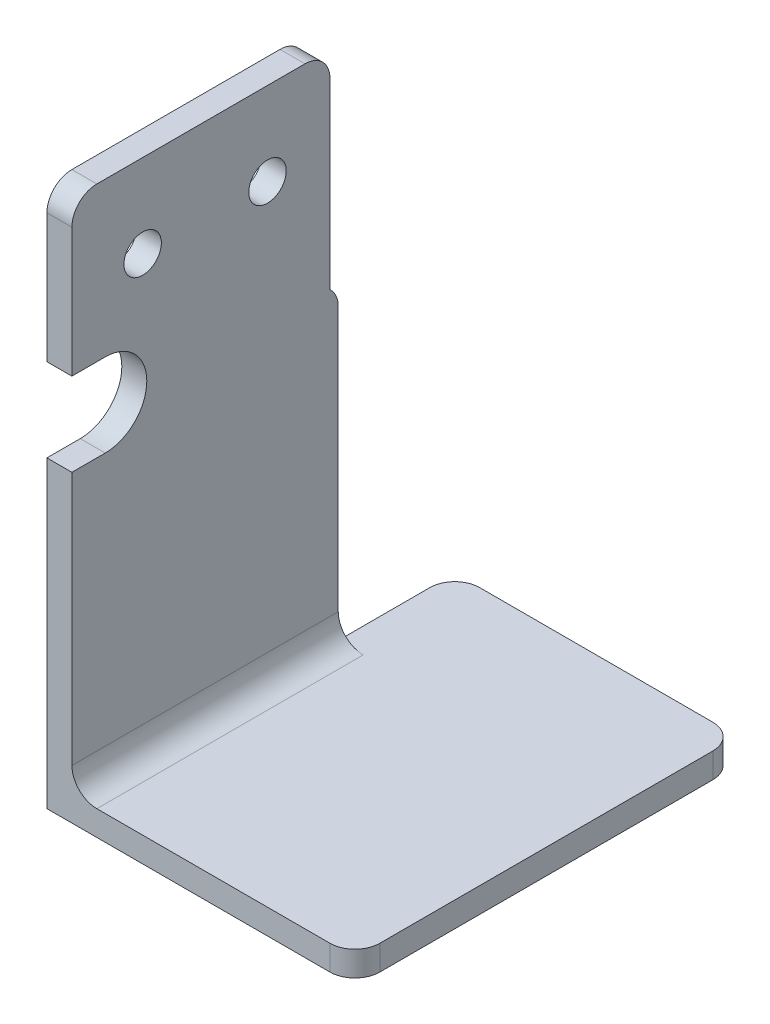
ISO-10303-21;
HEADER;
FILE_DESCRIPTION(('STEP AP214'),'2;1');
FILE_NAME('part.step','',(''),(''),'','','');
FILE_SCHEMA(('AUTOMOTIVE_DESIGN { 1 0 10303 214 1 1 1 1 }'));
ENDSEC;
DATA;
#1=APPLICATION_CONTEXT('core data for automotive mechanical design processes');
#2=APPLICATION_PROTOCOL_DEFINITION('international standard','automotive_design',2000,#1);
#3=PRODUCT_CONTEXT('',#1,'mechanical');
#4=PRODUCT('Part','Part','',(#3));
#5=PRODUCT_RELATED_PRODUCT_CATEGORY('part','',(#4));
#6=PRODUCT_DEFINITION_FORMATION('','',#4);
#7=PRODUCT_DEFINITION_CONTEXT('part definition',#1,'design');
#8=PRODUCT_DEFINITION('design','',#6,#7);
#9=PRODUCT_DEFINITION_SHAPE('','',#8);
#10=(LENGTH_UNIT() NAMED_UNIT(*) SI_UNIT(.MILLI.,.METRE.));
#11=(NAMED_UNIT(*) PLANE_ANGLE_UNIT() SI_UNIT($,.RADIAN.));
#12=(NAMED_UNIT(*) SI_UNIT($,.STERADIAN.) SOLID_ANGLE_UNIT());
#13=UNCERTAINTY_MEASURE_WITH_UNIT(LENGTH_MEASURE(1.E-05),#10,'distance_accuracy_value','');
#14=(GEOMETRIC_REPRESENTATION_CONTEXT(3) GLOBAL_UNCERTAINTY_ASSIGNED_CONTEXT((#13)) GLOBAL_UNIT_ASSIGNED_CONTEXT((#10,
#11,#12)) REPRESENTATION_CONTEXT('',''));
#15=CARTESIAN_POINT('',(0.,0.,0.));
#16=DIRECTION('',(0.,0.,1.));
#17=DIRECTION('',(1.,0.,0.));
#18=AXIS2_PLACEMENT_3D('',#15,#16,#17);
#19=CARTESIAN_POINT('',(0.,0.,46.));
#20=DIRECTION('',(0.,0.,-1.));
#21=DIRECTION('',(-1.,0.,0.));
#22=AXIS2_PLACEMENT_3D('',#19,#20,#21);
#23=PLANE('',#22);
#24=DIRECTION('',(0.,1.,0.));
#25=VECTOR('',#24,1.);
#26=CARTESIAN_POINT('',(3.,65.,46.));
#27=LINE('',#26,#25);
#28=CARTESIAN_POINT('',(3.,46.5,46.));
#29=VERTEX_POINT('',#28);
#30=CARTESIAN_POINT('',(3.,62.,46.));
#31=VERTEX_POINT('',#30);
#32=EDGE_CURVE('E243',#29,#31,#27,.T.);
#33=ORIENTED_EDGE('',*,*,#32,.T.);
#34=DIRECTION('',(-1.,0.,0.));
#35=VECTOR('',#34,1.);
#36=CARTESIAN_POINT('',(0.,62.,46.));
#37=LINE('',#36,#35);
#38=CARTESIAN_POINT('',(0.,62.,46.));
#39=VERTEX_POINT('',#38);
#40=EDGE_CURVE('E316',#31,#39,#37,.T.);
#41=ORIENTED_EDGE('',*,*,#40,.T.);
#42=DIRECTION('',(0.,-1.,0.));
#43=VECTOR('',#42,1.);
#44=CARTESIAN_POINT('',(0.,0.,46.));
#45=LINE('',#44,#43);
#46=CARTESIAN_POINT('',(0.,46.5,46.));
#47=VERTEX_POINT('',#46);
#48=EDGE_CURVE('E247',#39,#47,#45,.T.);
#49=ORIENTED_EDGE('',*,*,#48,.T.);
#50=DIRECTION('',(-1.,0.,0.));
#51=VECTOR('',#50,1.);
#52=CARTESIAN_POINT('',(3.,46.5,46.));
#53=LINE('',#52,#51);
#54=EDGE_CURVE('E227',#29,#47,#53,.T.);
#55=ORIENTED_EDGE('',*,*,#54,.F.);
#56=EDGE_LOOP('',(#33,#41,#49,#55));
#57=FACE_BOUND('',#56,.T.);
#58=ADVANCED_FACE('F33',(#57),#23,.F.);
#59=CARTESIAN_POINT('',(0.,0.,0.));
#60=DIRECTION('',(0.,0.,-1.));
#61=DIRECTION('',(-1.,0.,0.));
#62=AXIS2_PLACEMENT_3D('',#59,#60,#61);
#63=PLANE('',#62);
#64=DIRECTION('',(-1.,0.,0.));
#65=VECTOR('',#64,1.);
#66=CARTESIAN_POINT('',(3.00000000000001,3.,0.));
#67=LINE('',#66,#65);
#68=CARTESIAN_POINT('',(34.,3.,0.));
#69=VERTEX_POINT('',#68);
#70=CARTESIAN_POINT('',(6.,3.,0.));
#71=VERTEX_POINT('',#70);
#72=EDGE_CURVE('E240',#69,#71,#67,.T.);
#73=ORIENTED_EDGE('',*,*,#72,.F.);
#74=DIRECTION('',(0.,1.,0.));
#75=VECTOR('',#74,1.);
#76=CARTESIAN_POINT('',(34.,0.,0.));
#77=LINE('',#76,#75);
#78=CARTESIAN_POINT('',(34.,0.,0.));
#79=VERTEX_POINT('',#78);
#80=EDGE_CURVE('E56',#69,#79,#77,.F.);
#81=ORIENTED_EDGE('',*,*,#80,.T.);
#82=DIRECTION('',(1.,0.,0.));
#83=VECTOR('',#82,1.);
#84=CARTESIAN_POINT('',(37.,0.,0.));
#85=LINE('',#84,#83);
#86=CARTESIAN_POINT('',(6.00000000000001,0.,0.));
#87=VERTEX_POINT('',#86);
#88=EDGE_CURVE('E235',#87,#79,#85,.T.);
#89=ORIENTED_EDGE('',*,*,#88,.F.);
#90=DIRECTION('',(0.,1.,0.));
#91=VECTOR('',#90,1.);
#92=CARTESIAN_POINT('',(6.,0.,0.));
#93=LINE('',#92,#91);
#94=EDGE_CURVE('E311',#87,#71,#93,.T.);
#95=ORIENTED_EDGE('',*,*,#94,.T.);
#96=EDGE_LOOP('',(#73,#81,#89,#95));
#97=FACE_BOUND('',#96,.T.);
#98=ADVANCED_FACE('F363',(#97),#63,.T.);
#99=CARTESIAN_POINT('',(37.,0.,46.));
#100=DIRECTION('',(0.,1.,0.));
#101=DIRECTION('',(-1.,0.,0.));
#102=AXIS2_PLACEMENT_3D('',#99,#100,#101);
#103=PLANE('',#102);
#104=DIRECTION('',(0.,0.,-1.));
#105=VECTOR('',#104,1.);
#106=CARTESIAN_POINT('',(37.,0.,46.));
#107=LINE('',#106,#105);
#108=CARTESIAN_POINT('',(37.,0.,43.));
#109=VERTEX_POINT('',#108);
#110=CARTESIAN_POINT('',(37.,0.,3.));
#111=VERTEX_POINT('',#110);
#112=EDGE_CURVE('E262',#109,#111,#107,.T.);
#113=ORIENTED_EDGE('',*,*,#112,.F.);
#114=CARTESIAN_POINT('',(34.,0.,43.));
#115=DIRECTION('',(0.,1.,0.));
#116=DIRECTION('',(-1.,0.,0.));
#117=AXIS2_PLACEMENT_3D('',#114,#115,#116);
#118=CIRCLE('',#117,3.);
#119=CARTESIAN_POINT('',(34.,0.,46.));
#120=VERTEX_POINT('',#119);
#121=EDGE_CURVE('E309',#109,#120,#118,.F.);
#122=ORIENTED_EDGE('',*,*,#121,.T.);
#123=DIRECTION('',(1.,0.,0.));
#124=VECTOR('',#123,1.);
#125=CARTESIAN_POINT('',(37.,0.,46.));
#126=LINE('',#125,#124);
#127=CARTESIAN_POINT('',(0.,0.,46.));
#128=VERTEX_POINT('',#127);
#129=EDGE_CURVE('E236',#128,#120,#126,.T.);
#130=ORIENTED_EDGE('',*,*,#129,.F.);
#131=DIRECTION('',(0.,0.,-1.));
#132=VECTOR('',#131,1.);
#133=CARTESIAN_POINT('',(0.,0.,46.));
#134=LINE('',#133,#132);
#135=CARTESIAN_POINT('',(0.,0.,14.));
#136=VERTEX_POINT('',#135);
#137=EDGE_CURVE('E195',#128,#136,#134,.T.);
#138=ORIENTED_EDGE('',*,*,#137,.T.);
#139=DIRECTION('',(-1.,0.,0.));
#140=VECTOR('',#139,1.);
#141=CARTESIAN_POINT('',(3.,0.,14.));
#142=LINE('',#141,#140);
#143=CARTESIAN_POINT('',(3.,0.,14.));
#144=VERTEX_POINT('',#143);
#145=EDGE_CURVE('E186',#144,#136,#142,.T.);
#146=ORIENTED_EDGE('',*,*,#145,.F.);
#147=DIRECTION('',(0.,0.,1.));
#148=VECTOR('',#147,1.);
#149=CARTESIAN_POINT('',(3.,0.,0.));
#150=LINE('',#149,#148);
#151=CARTESIAN_POINT('',(3.,0.,3.));
#152=VERTEX_POINT('',#151);
#153=EDGE_CURVE('E172',#152,#144,#150,.T.);
#154=ORIENTED_EDGE('',*,*,#153,.F.);
#155=CARTESIAN_POINT('',(6.,0.,3.));
#156=DIRECTION('',(0.,1.,0.));
#157=DIRECTION('',(-1.,0.,0.));
#158=AXIS2_PLACEMENT_3D('',#155,#156,#157);
#159=CIRCLE('',#158,3.);
#160=EDGE_CURVE('E305',#152,#87,#159,.F.);
#161=ORIENTED_EDGE('',*,*,#160,.T.);
#162=ORIENTED_EDGE('',*,*,#88,.T.);
#163=CARTESIAN_POINT('',(34.,0.,3.));
#164=DIRECTION('',(0.,1.,0.));
#165=DIRECTION('',(-1.,0.,0.));
#166=AXIS2_PLACEMENT_3D('',#163,#164,#165);
#167=CIRCLE('',#166,3.);
#168=EDGE_CURVE('E307',#79,#111,#167,.F.);
#169=ORIENTED_EDGE('',*,*,#168,.T.);
#170=EDGE_LOOP('',(#113,#122,#130,#138,#146,#154,#161,#162,#169));
#171=FACE_BOUND('',#170,.T.);
#172=ADVANCED_FACE('F192',(#171),#103,.F.);
#173=CARTESIAN_POINT('',(37.,3.,46.));
#174=DIRECTION('',(-1.,0.,0.));
#175=DIRECTION('',(0.,0.,1.));
#176=AXIS2_PLACEMENT_3D('',#173,#174,#175);
#177=PLANE('',#176);
#178=DIRECTION('',(0.,0.,-1.));
#179=VECTOR('',#178,1.);
#180=CARTESIAN_POINT('',(37.,3.,46.));
#181=LINE('',#180,#179);
#182=CARTESIAN_POINT('',(37.,3.,43.));
#183=VERTEX_POINT('',#182);
#184=CARTESIAN_POINT('',(37.,3.,3.));
#185=VERTEX_POINT('',#184);
#186=EDGE_CURVE('E259',#183,#185,#181,.T.);
#187=ORIENTED_EDGE('',*,*,#186,.F.);
#188=DIRECTION('',(0.,1.,0.));
#189=VECTOR('',#188,1.);
#190=CARTESIAN_POINT('',(37.,3.,43.));
#191=LINE('',#190,#189);
#192=EDGE_CURVE('E303',#183,#109,#191,.F.);
#193=ORIENTED_EDGE('',*,*,#192,.T.);
#194=ORIENTED_EDGE('',*,*,#112,.T.);
#195=DIRECTION('',(0.,1.,0.));
#196=VECTOR('',#195,1.);
#197=CARTESIAN_POINT('',(37.,3.,3.));
#198=LINE('',#197,#196);
#199=EDGE_CURVE('E300',#111,#185,#198,.T.);
#200=ORIENTED_EDGE('',*,*,#199,.T.);
#201=EDGE_LOOP('',(#187,#193,#194,#200));
#202=FACE_BOUND('',#201,.T.);
#203=ADVANCED_FACE('F358',(#202),#177,.F.);
#204=CARTESIAN_POINT('',(3.00000000000001,3.,46.));
#205=DIRECTION('',(0.,-1.,0.));
#206=DIRECTION('',(1.,0.,0.));
#207=AXIS2_PLACEMENT_3D('',#204,#205,#206);
#208=PLANE('',#207);
#209=DIRECTION('',(0.,0.,-1.));
#210=VECTOR('',#209,1.);
#211=CARTESIAN_POINT('',(3.00000000000001,3.,46.));
#212=LINE('',#211,#210);
#213=CARTESIAN_POINT('',(3.,3.,14.));
#214=VERTEX_POINT('',#213);
#215=CARTESIAN_POINT('',(3.00000000000001,3.,3.));
#216=VERTEX_POINT('',#215);
#217=EDGE_CURVE('E199',#214,#216,#212,.T.);
#218=ORIENTED_EDGE('',*,*,#217,.F.);
#219=DIRECTION('',(1.,0.,0.));
#220=VECTOR('',#219,1.);
#221=CARTESIAN_POINT('',(3.,3.,14.));
#222=LINE('',#221,#220);
#223=CARTESIAN_POINT('',(6.00000000000001,3.,14.));
#224=VERTEX_POINT('',#223);
#225=EDGE_CURVE('E48',#214,#224,#222,.T.);
#226=ORIENTED_EDGE('',*,*,#225,.T.);
#227=DIRECTION('',(0.,0.,-1.));
#228=VECTOR('',#227,1.);
#229=CARTESIAN_POINT('',(6.00000000000001,3.,46.));
#230=LINE('',#229,#228);
#231=CARTESIAN_POINT('',(6.00000000000001,3.,46.));
#232=VERTEX_POINT('',#231);
#233=EDGE_CURVE('E286',#224,#232,#230,.F.);
#234=ORIENTED_EDGE('',*,*,#233,.T.);
#235=DIRECTION('',(-1.,0.,0.));
#236=VECTOR('',#235,1.);
#237=CARTESIAN_POINT('',(3.00000000000001,3.,46.));
#238=LINE('',#237,#236);
#239=CARTESIAN_POINT('',(34.,3.,46.));
#240=VERTEX_POINT('',#239);
#241=EDGE_CURVE('E239',#240,#232,#238,.T.);
#242=ORIENTED_EDGE('',*,*,#241,.F.);
#243=CARTESIAN_POINT('',(34.,3.,43.));
#244=DIRECTION('',(0.,-1.,0.));
#245=DIRECTION('',(1.,0.,0.));
#246=AXIS2_PLACEMENT_3D('',#243,#244,#245);
#247=CIRCLE('',#246,3.);
#248=EDGE_CURVE('E284',#240,#183,#247,.F.);
#249=ORIENTED_EDGE('',*,*,#248,.T.);
#250=ORIENTED_EDGE('',*,*,#186,.T.);
#251=CARTESIAN_POINT('',(34.,3.,3.));
#252=DIRECTION('',(0.,-1.,0.));
#253=DIRECTION('',(1.,0.,0.));
#254=AXIS2_PLACEMENT_3D('',#251,#252,#253);
#255=CIRCLE('',#254,3.);
#256=EDGE_CURVE('E282',#185,#69,#255,.F.);
#257=ORIENTED_EDGE('',*,*,#256,.T.);
#258=ORIENTED_EDGE('',*,*,#72,.T.);
#259=CARTESIAN_POINT('',(6.,3.,3.));
#260=DIRECTION('',(0.,-1.,0.));
#261=DIRECTION('',(1.,0.,0.));
#262=AXIS2_PLACEMENT_3D('',#259,#260,#261);
#263=CIRCLE('',#262,3.);
#264=EDGE_CURVE('E280',#71,#216,#263,.F.);
#265=ORIENTED_EDGE('',*,*,#264,.T.);
#266=EDGE_LOOP('',(#218,#226,#234,#242,#249,#250,#257,#258,#265));
#267=FACE_BOUND('',#266,.T.);
#268=ADVANCED_FACE('F331',(#267),#208,.F.);
#269=CARTESIAN_POINT('',(3.,65.,46.));
#270=DIRECTION('',(-1.,0.,0.));
#271=DIRECTION('',(0.,-1.,0.));
#272=AXIS2_PLACEMENT_3D('',#269,#270,#271);
#273=PLANE('',#272);
#274=CARTESIAN_POINT('',(3.,55.,37.5));
#275=DIRECTION('',(1.,0.,0.));
#276=DIRECTION('',(0.,1.,0.));
#277=AXIS2_PLACEMENT_3D('',#274,#275,#276);
#278=CIRCLE('',#277,2.25);
#279=CARTESIAN_POINT('',(3.,57.25,37.5));
#280=VERTEX_POINT('',#279);
#281=EDGE_CURVE('E269',#280,#280,#278,.T.);
#282=ORIENTED_EDGE('',*,*,#281,.F.);
#283=EDGE_LOOP('',(#282));
#284=FACE_BOUND('',#283,.T.);
#285=CARTESIAN_POINT('',(3.,55.,22.5));
#286=DIRECTION('',(1.,0.,0.));
#287=DIRECTION('',(0.,1.,0.));
#288=AXIS2_PLACEMENT_3D('',#285,#286,#287);
#289=CIRCLE('',#288,2.25);
#290=CARTESIAN_POINT('',(3.,57.25,22.5));
#291=VERTEX_POINT('',#290);
#292=EDGE_CURVE('E491',#291,#291,#289,.T.);
#293=ORIENTED_EDGE('',*,*,#292,.F.);
#294=EDGE_LOOP('',(#293));
#295=FACE_BOUND('',#294,.T.);
#296=CARTESIAN_POINT('',(3.00000000000001,6.,46.));
#297=VERTEX_POINT('',#296);
#298=CARTESIAN_POINT('',(3.,36.5,46.));
#299=VERTEX_POINT('',#298);
#300=EDGE_CURVE('E244',#297,#299,#27,.T.);
#301=ORIENTED_EDGE('',*,*,#300,.F.);
#302=DIRECTION('',(0.,0.,-1.));
#303=VECTOR('',#302,1.);
#304=CARTESIAN_POINT('',(3.00000000000001,6.,14.));
#305=LINE('',#304,#303);
#306=CARTESIAN_POINT('',(3.,6.,14.));
#307=VERTEX_POINT('',#306);
#308=EDGE_CURVE('E277',#297,#307,#305,.T.);
#309=ORIENTED_EDGE('',*,*,#308,.T.);
#310=DIRECTION('',(0.,1.,0.));
#311=VECTOR('',#310,1.);
#312=CARTESIAN_POINT('',(3.,0.,14.));
#313=LINE('',#312,#311);
#314=CARTESIAN_POINT('',(3.,37.7639320225002,14.));
#315=VERTEX_POINT('',#314);
#316=EDGE_CURVE('E181',#307,#315,#313,.T.);
#317=ORIENTED_EDGE('',*,*,#316,.T.);
#318=CARTESIAN_POINT('',(3.,37.7639320225002,17.));
#319=DIRECTION('',(-1.,0.,0.));
#320=DIRECTION('',(0.,-1.,0.));
#321=AXIS2_PLACEMENT_3D('',#318,#319,#320);
#322=CIRCLE('',#321,3.);
#323=CARTESIAN_POINT('',(3.,40.,15.));
#324=VERTEX_POINT('',#323);
#325=EDGE_CURVE('E275',#315,#324,#322,.F.);
#326=ORIENTED_EDGE('',*,*,#325,.T.);
#327=DIRECTION('',(0.,1.,0.));
#328=VECTOR('',#327,1.);
#329=CARTESIAN_POINT('',(3.,40.,15.));
#330=LINE('',#329,#328);
#331=CARTESIAN_POINT('',(3.,62.,15.));
#332=VERTEX_POINT('',#331);
#333=EDGE_CURVE('E188',#324,#332,#330,.T.);
#334=ORIENTED_EDGE('',*,*,#333,.T.);
#335=CARTESIAN_POINT('',(3.,62.,18.));
#336=DIRECTION('',(-1.,0.,0.));
#337=DIRECTION('',(0.,-1.,0.));
#338=AXIS2_PLACEMENT_3D('',#335,#336,#337);
#339=CIRCLE('',#338,3.);
#340=CARTESIAN_POINT('',(3.,65.,18.));
#341=VERTEX_POINT('',#340);
#342=EDGE_CURVE('E265',#332,#341,#339,.F.);
#343=ORIENTED_EDGE('',*,*,#342,.T.);
#344=DIRECTION('',(0.,0.,-1.));
#345=VECTOR('',#344,1.);
#346=CARTESIAN_POINT('',(3.,65.,46.));
#347=LINE('',#346,#345);
#348=CARTESIAN_POINT('',(3.,65.,43.));
#349=VERTEX_POINT('',#348);
#350=EDGE_CURVE('E256',#349,#341,#347,.T.);
#351=ORIENTED_EDGE('',*,*,#350,.F.);
#352=CARTESIAN_POINT('',(3.,62.,43.));
#353=DIRECTION('',(-1.,0.,0.));
#354=DIRECTION('',(0.,-1.,0.));
#355=AXIS2_PLACEMENT_3D('',#352,#353,#354);
#356=CIRCLE('',#355,3.);
#357=EDGE_CURVE('E273',#349,#31,#356,.F.);
#358=ORIENTED_EDGE('',*,*,#357,.T.);
#359=ORIENTED_EDGE('',*,*,#32,.F.);
#360=DIRECTION('',(0.,0.,-1.));
#361=VECTOR('',#360,1.);
#362=CARTESIAN_POINT('',(3.,46.5,42.));
#363=LINE('',#362,#361);
#364=CARTESIAN_POINT('',(3.,46.5,42.));
#365=VERTEX_POINT('',#364);
#366=EDGE_CURVE('E212',#29,#365,#363,.T.);
#367=ORIENTED_EDGE('',*,*,#366,.T.);
#368=CARTESIAN_POINT('',(3.,41.5,42.));
#369=DIRECTION('',(-1.,0.,0.));
#370=DIRECTION('',(0.,0.,-1.));
#371=AXIS2_PLACEMENT_3D('',#368,#369,#370);
#372=CIRCLE('',#371,5.);
#373=CARTESIAN_POINT('',(3.,36.5,42.));
#374=VERTEX_POINT('',#373);
#375=EDGE_CURVE('E205',#365,#374,#372,.T.);
#376=ORIENTED_EDGE('',*,*,#375,.T.);
#377=DIRECTION('',(0.,0.,1.));
#378=VECTOR('',#377,1.);
#379=CARTESIAN_POINT('',(3.,36.5,46.));
#380=LINE('',#379,#378);
#381=EDGE_CURVE('E208',#374,#299,#380,.T.);
#382=ORIENTED_EDGE('',*,*,#381,.T.);
#383=EDGE_LOOP('',(#301,#309,#317,#326,#334,#343,#351,#358,#359,#367,#376,#382));
#384=FACE_BOUND('',#383,.T.);
#385=ADVANCED_FACE('F340',(#284,#295,#384),#273,.F.);
#386=CARTESIAN_POINT('',(0.,65.,46.));
#387=DIRECTION('',(0.,-1.,0.));
#388=DIRECTION('',(0.,0.,-1.));
#389=AXIS2_PLACEMENT_3D('',#386,#387,#388);
#390=PLANE('',#389);
#391=DIRECTION('',(0.,0.,-1.));
#392=VECTOR('',#391,1.);
#393=CARTESIAN_POINT('',(0.,65.,46.));
#394=LINE('',#393,#392);
#395=CARTESIAN_POINT('',(0.,65.,43.));
#396=VERTEX_POINT('',#395);
#397=CARTESIAN_POINT('',(0.,65.,18.));
#398=VERTEX_POINT('',#397);
#399=EDGE_CURVE('E253',#396,#398,#394,.T.);
#400=ORIENTED_EDGE('',*,*,#399,.F.);
#401=DIRECTION('',(-1.,0.,0.));
#402=VECTOR('',#401,1.);
#403=CARTESIAN_POINT('',(0.,65.,43.));
#404=LINE('',#403,#402);
#405=EDGE_CURVE('E322',#396,#349,#404,.F.);
#406=ORIENTED_EDGE('',*,*,#405,.T.);
#407=ORIENTED_EDGE('',*,*,#350,.T.);
#408=DIRECTION('',(-1.,0.,0.));
#409=VECTOR('',#408,1.);
#410=CARTESIAN_POINT('',(0.,65.,18.));
#411=LINE('',#410,#409);
#412=EDGE_CURVE('E319',#341,#398,#411,.T.);
#413=ORIENTED_EDGE('',*,*,#412,.T.);
#414=EDGE_LOOP('',(#400,#406,#407,#413));
#415=FACE_BOUND('',#414,.T.);
#416=ADVANCED_FACE('F392',(#415),#390,.F.);
#417=CARTESIAN_POINT('',(0.,0.,46.));
#418=DIRECTION('',(1.,0.,0.));
#419=DIRECTION('',(0.,0.,-1.));
#420=AXIS2_PLACEMENT_3D('',#417,#418,#419);
#421=PLANE('',#420);
#422=CARTESIAN_POINT('',(0.,55.,37.5));
#423=DIRECTION('',(1.,0.,0.));
#424=DIRECTION('',(0.,0.,-1.));
#425=AXIS2_PLACEMENT_3D('',#422,#423,#424);
#426=CIRCLE('',#425,2.25);
#427=CARTESIAN_POINT('',(0.,55.,35.25));
#428=VERTEX_POINT('',#427);
#429=EDGE_CURVE('E220',#428,#428,#426,.T.);
#430=ORIENTED_EDGE('',*,*,#429,.T.);
#431=EDGE_LOOP('',(#430));
#432=FACE_BOUND('',#431,.T.);
#433=CARTESIAN_POINT('',(0.,55.,22.5));
#434=DIRECTION('',(1.,0.,0.));
#435=DIRECTION('',(0.,0.,-1.));
#436=AXIS2_PLACEMENT_3D('',#433,#434,#435);
#437=CIRCLE('',#436,2.25);
#438=CARTESIAN_POINT('',(0.,55.,20.25));
#439=VERTEX_POINT('',#438);
#440=EDGE_CURVE('E266',#439,#439,#437,.T.);
#441=ORIENTED_EDGE('',*,*,#440,.T.);
#442=EDGE_LOOP('',(#441));
#443=FACE_BOUND('',#442,.T.);
#444=DIRECTION('',(0.,1.,0.));
#445=VECTOR('',#444,1.);
#446=CARTESIAN_POINT('',(0.,40.,15.));
#447=LINE('',#446,#445);
#448=CARTESIAN_POINT('',(0.,40.,15.));
#449=VERTEX_POINT('',#448);
#450=CARTESIAN_POINT('',(0.,62.,15.));
#451=VERTEX_POINT('',#450);
#452=EDGE_CURVE('E182',#449,#451,#447,.T.);
#453=ORIENTED_EDGE('',*,*,#452,.F.);
#454=CARTESIAN_POINT('',(0.,37.7639320225002,17.));
#455=DIRECTION('',(1.,0.,0.));
#456=DIRECTION('',(0.,0.,-1.));
#457=AXIS2_PLACEMENT_3D('',#454,#455,#456);
#458=CIRCLE('',#457,3.);
#459=CARTESIAN_POINT('',(0.,37.7639320225002,14.));
#460=VERTEX_POINT('',#459);
#461=EDGE_CURVE('E293',#449,#460,#458,.F.);
#462=ORIENTED_EDGE('',*,*,#461,.T.);
#463=DIRECTION('',(0.,1.,0.));
#464=VECTOR('',#463,1.);
#465=CARTESIAN_POINT('',(0.,0.,14.));
#466=LINE('',#465,#464);
#467=EDGE_CURVE('E226',#136,#460,#466,.T.);
#468=ORIENTED_EDGE('',*,*,#467,.F.);
#469=ORIENTED_EDGE('',*,*,#137,.F.);
#470=CARTESIAN_POINT('',(0.,36.5,46.));
#471=VERTEX_POINT('',#470);
#472=EDGE_CURVE('E246',#471,#128,#45,.T.);
#473=ORIENTED_EDGE('',*,*,#472,.F.);
#474=DIRECTION('',(0.,0.,1.));
#475=VECTOR('',#474,1.);
#476=CARTESIAN_POINT('',(0.,36.5,46.));
#477=LINE('',#476,#475);
#478=CARTESIAN_POINT('',(0.,36.5,42.));
#479=VERTEX_POINT('',#478);
#480=EDGE_CURVE('E219',#479,#471,#477,.T.);
#481=ORIENTED_EDGE('',*,*,#480,.F.);
#482=CARTESIAN_POINT('',(0.,41.5,42.));
#483=DIRECTION('',(-1.,0.,0.));
#484=DIRECTION('',(0.,0.,-1.));
#485=AXIS2_PLACEMENT_3D('',#482,#483,#484);
#486=CIRCLE('',#485,5.);
#487=CARTESIAN_POINT('',(0.,46.5,42.));
#488=VERTEX_POINT('',#487);
#489=EDGE_CURVE('E216',#488,#479,#486,.T.);
#490=ORIENTED_EDGE('',*,*,#489,.F.);
#491=DIRECTION('',(0.,0.,-1.));
#492=VECTOR('',#491,1.);
#493=CARTESIAN_POINT('',(0.,46.5,42.));
#494=LINE('',#493,#492);
#495=EDGE_CURVE('E209',#47,#488,#494,.T.);
#496=ORIENTED_EDGE('',*,*,#495,.F.);
#497=ORIENTED_EDGE('',*,*,#48,.F.);
#498=CARTESIAN_POINT('',(0.,62.,43.));
#499=DIRECTION('',(1.,0.,0.));
#500=DIRECTION('',(0.,0.,-1.));
#501=AXIS2_PLACEMENT_3D('',#498,#499,#500);
#502=CIRCLE('',#501,3.);
#503=EDGE_CURVE('E291',#39,#396,#502,.F.);
#504=ORIENTED_EDGE('',*,*,#503,.T.);
#505=ORIENTED_EDGE('',*,*,#399,.T.);
#506=CARTESIAN_POINT('',(0.,62.,18.));
#507=DIRECTION('',(1.,0.,0.));
#508=DIRECTION('',(0.,0.,-1.));
#509=AXIS2_PLACEMENT_3D('',#506,#507,#508);
#510=CIRCLE('',#509,3.);
#511=EDGE_CURVE('E289',#398,#451,#510,.F.);
#512=ORIENTED_EDGE('',*,*,#511,.T.);
#513=EDGE_LOOP('',(#453,#462,#468,#469,#473,#481,#490,#496,#497,#504,#505,#512));
#514=FACE_BOUND('',#513,.T.);
#515=ADVANCED_FACE('F349',(#432,#443,#514),#421,.F.);
#516=ORIENTED_EDGE('',*,*,#129,.T.);
#517=DIRECTION('',(0.,1.,0.));
#518=VECTOR('',#517,1.);
#519=CARTESIAN_POINT('',(34.,0.,46.));
#520=LINE('',#519,#518);
#521=EDGE_CURVE('E297',#120,#240,#520,.T.);
#522=ORIENTED_EDGE('',*,*,#521,.T.);
#523=ORIENTED_EDGE('',*,*,#241,.T.);
#524=CARTESIAN_POINT('',(6.00000000000001,6.,46.));
#525=DIRECTION('',(0.,0.,-1.));
#526=DIRECTION('',(-1.,0.,0.));
#527=AXIS2_PLACEMENT_3D('',#524,#525,#526);
#528=CIRCLE('',#527,3.);
#529=EDGE_CURVE('E11',#232,#297,#528,.T.);
#530=ORIENTED_EDGE('',*,*,#529,.T.);
#531=ORIENTED_EDGE('',*,*,#300,.T.);
#532=DIRECTION('',(-1.,0.,0.));
#533=VECTOR('',#532,1.);
#534=CARTESIAN_POINT('',(3.,36.5,46.));
#535=LINE('',#534,#533);
#536=EDGE_CURVE('E230',#299,#471,#535,.T.);
#537=ORIENTED_EDGE('',*,*,#536,.T.);
#538=ORIENTED_EDGE('',*,*,#472,.T.);
#539=EDGE_LOOP('',(#516,#522,#523,#530,#531,#537,#538));
#540=FACE_BOUND('',#539,.T.);
#541=ADVANCED_FACE('F337',(#540),#23,.F.);
#542=CARTESIAN_POINT('',(3.,0.,0.));
#543=DIRECTION('',(-1.,0.,0.));
#544=DIRECTION('',(0.,0.,1.));
#545=AXIS2_PLACEMENT_3D('',#542,#543,#544);
#546=PLANE('',#545);
#547=ORIENTED_EDGE('',*,*,#217,.T.);
#548=DIRECTION('',(0.,1.,0.));
#549=VECTOR('',#548,1.);
#550=CARTESIAN_POINT('',(3.,0.,3.));
#551=LINE('',#550,#549);
#552=EDGE_CURVE('E177',#216,#152,#551,.F.);
#553=ORIENTED_EDGE('',*,*,#552,.T.);
#554=ORIENTED_EDGE('',*,*,#153,.T.);
#555=EDGE_CURVE('E175',#144,#214,#313,.T.);
#556=ORIENTED_EDGE('',*,*,#555,.T.);
#557=EDGE_LOOP('',(#547,#553,#554,#556));
#558=FACE_BOUND('',#557,.T.);
#559=ADVANCED_FACE('F174',(#558),#546,.T.);
#560=CARTESIAN_POINT('',(3.,40.,15.));
#561=DIRECTION('',(0.,0.,1.));
#562=DIRECTION('',(1.,0.,0.));
#563=AXIS2_PLACEMENT_3D('',#560,#561,#562);
#564=PLANE('',#563);
#565=ORIENTED_EDGE('',*,*,#452,.T.);
#566=DIRECTION('',(-1.,0.,0.));
#567=VECTOR('',#566,1.);
#568=CARTESIAN_POINT('',(3.,62.,15.));
#569=LINE('',#568,#567);
#570=EDGE_CURVE('E324',#451,#332,#569,.F.);
#571=ORIENTED_EDGE('',*,*,#570,.T.);
#572=ORIENTED_EDGE('',*,*,#333,.F.);
#573=DIRECTION('',(-1.,0.,0.));
#574=VECTOR('',#573,1.);
#575=CARTESIAN_POINT('',(3.,40.,15.));
#576=LINE('',#575,#574);
#577=EDGE_CURVE('E196',#324,#449,#576,.T.);
#578=ORIENTED_EDGE('',*,*,#577,.T.);
#579=EDGE_LOOP('',(#565,#571,#572,#578));
#580=FACE_BOUND('',#579,.T.);
#581=ADVANCED_FACE('F390',(#580),#564,.F.);
#582=CARTESIAN_POINT('',(3.,0.,14.));
#583=DIRECTION('',(0.,0.,1.));
#584=DIRECTION('',(0.,-1.,0.));
#585=AXIS2_PLACEMENT_3D('',#582,#583,#584);
#586=PLANE('',#585);
#587=ORIENTED_EDGE('',*,*,#467,.T.);
#588=DIRECTION('',(-1.,0.,0.));
#589=VECTOR('',#588,1.);
#590=CARTESIAN_POINT('',(3.,37.7639320225002,14.));
#591=LINE('',#590,#589);
#592=EDGE_CURVE('E295',#460,#315,#591,.F.);
#593=ORIENTED_EDGE('',*,*,#592,.T.);
#594=ORIENTED_EDGE('',*,*,#316,.F.);
#595=CARTESIAN_POINT('',(6.00000000000001,6.,14.));
#596=DIRECTION('',(0.,0.,1.));
#597=DIRECTION('',(0.,-1.,0.));
#598=AXIS2_PLACEMENT_3D('',#595,#596,#597);
#599=CIRCLE('',#598,3.);
#600=EDGE_CURVE('E41',#307,#224,#599,.T.);
#601=ORIENTED_EDGE('',*,*,#600,.T.);
#602=ORIENTED_EDGE('',*,*,#225,.F.);
#603=ORIENTED_EDGE('',*,*,#555,.F.);
#604=ORIENTED_EDGE('',*,*,#145,.T.);
#605=EDGE_LOOP('',(#587,#593,#594,#601,#602,#603,#604));
#606=FACE_BOUND('',#605,.T.);
#607=ADVANCED_FACE('F185',(#606),#586,.F.);
#608=CARTESIAN_POINT('',(3.,41.5,42.));
#609=DIRECTION('',(-1.,0.,0.));
#610=DIRECTION('',(0.,0.,1.));
#611=AXIS2_PLACEMENT_3D('',#608,#609,#610);
#612=CYLINDRICAL_SURFACE('',#611,5.);
#613=ORIENTED_EDGE('',*,*,#489,.T.);
#614=DIRECTION('',(-1.,0.,0.));
#615=VECTOR('',#614,1.);
#616=CARTESIAN_POINT('',(3.,36.5,42.));
#617=LINE('',#616,#615);
#618=EDGE_CURVE('E215',#374,#479,#617,.T.);
#619=ORIENTED_EDGE('',*,*,#618,.F.);
#620=ORIENTED_EDGE('',*,*,#375,.F.);
#621=DIRECTION('',(-1.,0.,0.));
#622=VECTOR('',#621,1.);
#623=CARTESIAN_POINT('',(3.,46.5,42.));
#624=LINE('',#623,#622);
#625=EDGE_CURVE('E224',#365,#488,#624,.T.);
#626=ORIENTED_EDGE('',*,*,#625,.T.);
#627=EDGE_LOOP('',(#613,#619,#620,#626));
#628=FACE_BOUND('',#627,.T.);
#629=ADVANCED_FACE('F465',(#628),#612,.F.);
#630=CARTESIAN_POINT('',(3.,46.5,42.));
#631=DIRECTION('',(0.,1.,0.));
#632=DIRECTION('',(0.,0.,1.));
#633=AXIS2_PLACEMENT_3D('',#630,#631,#632);
#634=PLANE('',#633);
#635=ORIENTED_EDGE('',*,*,#495,.T.);
#636=ORIENTED_EDGE('',*,*,#625,.F.);
#637=ORIENTED_EDGE('',*,*,#366,.F.);
#638=ORIENTED_EDGE('',*,*,#54,.T.);
#639=EDGE_LOOP('',(#635,#636,#637,#638));
#640=FACE_BOUND('',#639,.T.);
#641=ADVANCED_FACE('F463',(#640),#634,.F.);
#642=CARTESIAN_POINT('',(3.,36.5,46.));
#643=DIRECTION('',(0.,-1.,0.));
#644=DIRECTION('',(0.,0.,-1.));
#645=AXIS2_PLACEMENT_3D('',#642,#643,#644);
#646=PLANE('',#645);
#647=ORIENTED_EDGE('',*,*,#480,.T.);
#648=ORIENTED_EDGE('',*,*,#536,.F.);
#649=ORIENTED_EDGE('',*,*,#381,.F.);
#650=ORIENTED_EDGE('',*,*,#618,.T.);
#651=EDGE_LOOP('',(#647,#648,#649,#650));
#652=FACE_BOUND('',#651,.T.);
#653=ADVANCED_FACE('F344',(#652),#646,.F.);
#654=CARTESIAN_POINT('',(-43.,55.,22.5));
#655=DIRECTION('',(1.,0.,0.));
#656=DIRECTION('',(0.,1.,0.));
#657=AXIS2_PLACEMENT_3D('',#654,#655,#656);
#658=CYLINDRICAL_SURFACE('',#657,2.25);
#659=ORIENTED_EDGE('',*,*,#292,.T.);
#660=EDGE_LOOP('',(#659));
#661=FACE_BOUND('',#660,.T.);
#662=ORIENTED_EDGE('',*,*,#440,.F.);
#663=EDGE_LOOP('',(#662));
#664=FACE_BOUND('',#663,.T.);
#665=ADVANCED_FACE('F475',(#661,#664),#658,.F.);
#666=CARTESIAN_POINT('',(-43.,55.,37.5));
#667=DIRECTION('',(1.,0.,0.));
#668=DIRECTION('',(0.,1.,0.));
#669=AXIS2_PLACEMENT_3D('',#666,#667,#668);
#670=CYLINDRICAL_SURFACE('',#669,2.25);
#671=ORIENTED_EDGE('',*,*,#281,.T.);
#672=EDGE_LOOP('',(#671));
#673=FACE_BOUND('',#672,.T.);
#674=ORIENTED_EDGE('',*,*,#429,.F.);
#675=EDGE_LOOP('',(#674));
#676=FACE_BOUND('',#675,.T.);
#677=ADVANCED_FACE('F414',(#673,#676),#670,.F.);
#678=CARTESIAN_POINT('',(6.00000000000001,6.,46.));
#679=DIRECTION('',(0.,0.,1.));
#680=DIRECTION('',(1.,0.,0.));
#681=AXIS2_PLACEMENT_3D('',#678,#679,#680);
#682=CYLINDRICAL_SURFACE('',#681,3.);
#683=ORIENTED_EDGE('',*,*,#529,.F.);
#684=ORIENTED_EDGE('',*,*,#233,.F.);
#685=ORIENTED_EDGE('',*,*,#600,.F.);
#686=ORIENTED_EDGE('',*,*,#308,.F.);
#687=EDGE_LOOP('',(#683,#684,#685,#686));
#688=FACE_BOUND('',#687,.T.);
#689=ADVANCED_FACE('F334',(#688),#682,.F.);
#690=CARTESIAN_POINT('',(3.,37.7639320225002,17.));
#691=DIRECTION('',(-1.,0.,0.));
#692=DIRECTION('',(0.,0.,1.));
#693=AXIS2_PLACEMENT_3D('',#690,#691,#692);
#694=CYLINDRICAL_SURFACE('',#693,3.);
#695=ORIENTED_EDGE('',*,*,#325,.F.);
#696=ORIENTED_EDGE('',*,*,#592,.F.);
#697=ORIENTED_EDGE('',*,*,#461,.F.);
#698=ORIENTED_EDGE('',*,*,#577,.F.);
#699=EDGE_LOOP('',(#695,#696,#697,#698));
#700=FACE_BOUND('',#699,.T.);
#701=ADVANCED_FACE('F413',(#700),#694,.T.);
#702=CARTESIAN_POINT('',(34.,0.,43.));
#703=DIRECTION('',(0.,1.,0.));
#704=DIRECTION('',(0.,0.,1.));
#705=AXIS2_PLACEMENT_3D('',#702,#703,#704);
#706=CYLINDRICAL_SURFACE('',#705,3.);
#707=ORIENTED_EDGE('',*,*,#121,.F.);
#708=ORIENTED_EDGE('',*,*,#192,.F.);
#709=ORIENTED_EDGE('',*,*,#248,.F.);
#710=ORIENTED_EDGE('',*,*,#521,.F.);
#711=EDGE_LOOP('',(#707,#708,#709,#710));
#712=FACE_BOUND('',#711,.T.);
#713=ADVANCED_FACE('F354',(#712),#706,.T.);
#714=CARTESIAN_POINT('',(34.,3.,3.));
#715=DIRECTION('',(0.,-1.,0.));
#716=DIRECTION('',(0.,0.,-1.));
#717=AXIS2_PLACEMENT_3D('',#714,#715,#716);
#718=CYLINDRICAL_SURFACE('',#717,3.);
#719=ORIENTED_EDGE('',*,*,#168,.F.);
#720=ORIENTED_EDGE('',*,*,#80,.F.);
#721=ORIENTED_EDGE('',*,*,#256,.F.);
#722=ORIENTED_EDGE('',*,*,#199,.F.);
#723=EDGE_LOOP('',(#719,#720,#721,#722));
#724=FACE_BOUND('',#723,.T.);
#725=ADVANCED_FACE('F362',(#724),#718,.T.);
#726=CARTESIAN_POINT('',(6.,0.,3.));
#727=DIRECTION('',(0.,1.,0.));
#728=DIRECTION('',(0.,0.,1.));
#729=AXIS2_PLACEMENT_3D('',#726,#727,#728);
#730=CYLINDRICAL_SURFACE('',#729,3.);
#731=ORIENTED_EDGE('',*,*,#160,.F.);
#732=ORIENTED_EDGE('',*,*,#552,.F.);
#733=ORIENTED_EDGE('',*,*,#264,.F.);
#734=ORIENTED_EDGE('',*,*,#94,.F.);
#735=EDGE_LOOP('',(#731,#732,#733,#734));
#736=FACE_BOUND('',#735,.T.);
#737=ADVANCED_FACE('F366',(#736),#730,.T.);
#738=CARTESIAN_POINT('',(0.,62.,43.));
#739=DIRECTION('',(-1.,0.,0.));
#740=DIRECTION('',(0.,0.,1.));
#741=AXIS2_PLACEMENT_3D('',#738,#739,#740);
#742=CYLINDRICAL_SURFACE('',#741,3.);
#743=ORIENTED_EDGE('',*,*,#357,.F.);
#744=ORIENTED_EDGE('',*,*,#405,.F.);
#745=ORIENTED_EDGE('',*,*,#503,.F.);
#746=ORIENTED_EDGE('',*,*,#40,.F.);
#747=EDGE_LOOP('',(#743,#744,#745,#746));
#748=FACE_BOUND('',#747,.T.);
#749=ADVANCED_FACE('F368',(#748),#742,.T.);
#750=CARTESIAN_POINT('',(0.,62.,18.));
#751=DIRECTION('',(-1.,0.,0.));
#752=DIRECTION('',(0.,0.,1.));
#753=AXIS2_PLACEMENT_3D('',#750,#751,#752);
#754=CYLINDRICAL_SURFACE('',#753,3.);
#755=ORIENTED_EDGE('',*,*,#342,.F.);
#756=ORIENTED_EDGE('',*,*,#570,.F.);
#757=ORIENTED_EDGE('',*,*,#511,.F.);
#758=ORIENTED_EDGE('',*,*,#412,.F.);
#759=EDGE_LOOP('',(#755,#756,#757,#758));
#760=FACE_BOUND('',#759,.T.);
#761=ADVANCED_FACE('F35',(#760),#754,.T.);
#762=CLOSED_SHELL('',(#58,#98,#172,#203,#268,#385,#416,#515,#541,#559,#581,#607,#629,#641,#653,
#665,#677,#689,#701,#713,#725,#737,#749,#761));
#763=MANIFOLD_SOLID_BREP('B2',#762);
#764=ADVANCED_BREP_SHAPE_REPRESENTATION('',(#18,#763),#14);
#765=SHAPE_DEFINITION_REPRESENTATION(#9,#764);
ENDSEC;
END-ISO-10303-21;
